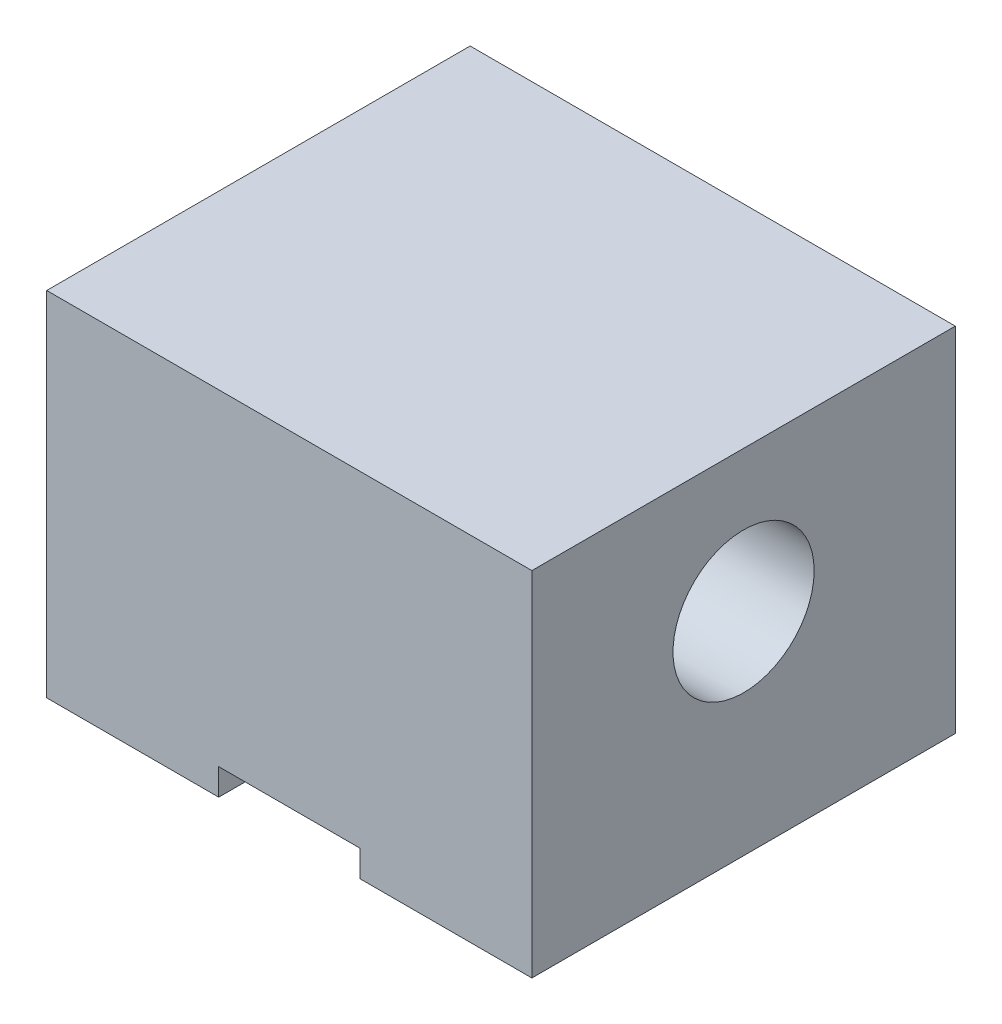
ISO-10303-21;
HEADER;
FILE_DESCRIPTION(('STEP AP214'),'2;1');
FILE_NAME('part.step','',(''),(''),'','','');
FILE_SCHEMA(('AUTOMOTIVE_DESIGN { 1 0 10303 214 1 1 1 1 }'));
ENDSEC;
DATA;
#1=APPLICATION_CONTEXT('core data for automotive mechanical design processes');
#2=APPLICATION_PROTOCOL_DEFINITION('international standard','automotive_design',2000,#1);
#3=PRODUCT_CONTEXT('',#1,'mechanical');
#4=PRODUCT('Part','Part','',(#3));
#5=PRODUCT_RELATED_PRODUCT_CATEGORY('part','',(#4));
#6=PRODUCT_DEFINITION_FORMATION('','',#4);
#7=PRODUCT_DEFINITION_CONTEXT('part definition',#1,'design');
#8=PRODUCT_DEFINITION('design','',#6,#7);
#9=PRODUCT_DEFINITION_SHAPE('','',#8);
#10=(LENGTH_UNIT() NAMED_UNIT(*) SI_UNIT(.MILLI.,.METRE.));
#11=(NAMED_UNIT(*) PLANE_ANGLE_UNIT() SI_UNIT($,.RADIAN.));
#12=(NAMED_UNIT(*) SI_UNIT($,.STERADIAN.) SOLID_ANGLE_UNIT());
#13=UNCERTAINTY_MEASURE_WITH_UNIT(LENGTH_MEASURE(1.E-05),#10,'distance_accuracy_value','');
#14=(GEOMETRIC_REPRESENTATION_CONTEXT(3) GLOBAL_UNCERTAINTY_ASSIGNED_CONTEXT((#13)) GLOBAL_UNIT_ASSIGNED_CONTEXT((#10,
#11,#12)) REPRESENTATION_CONTEXT('',''));
#15=CARTESIAN_POINT('',(0.,0.,0.));
#16=DIRECTION('',(0.,0.,1.));
#17=DIRECTION('',(1.,0.,0.));
#18=AXIS2_PLACEMENT_3D('',#15,#16,#17);
#19=CARTESIAN_POINT('',(0.,0.,0.));
#20=DIRECTION('',(0.,1.,0.));
#21=DIRECTION('',(0.,0.,1.));
#22=AXIS2_PLACEMENT_3D('',#19,#20,#21);
#23=PLANE('',#22);
#24=DIRECTION('',(1.,0.,0.));
#25=VECTOR('',#24,1.);
#26=CARTESIAN_POINT('',(-43.65625,0.,38.1));
#27=LINE('',#26,#25);
#28=CARTESIAN_POINT('',(12.7,0.,38.1));
#29=VERTEX_POINT('',#28);
#30=CARTESIAN_POINT('',(43.65625,0.,38.1));
#31=VERTEX_POINT('',#30);
#32=EDGE_CURVE('E79',#29,#31,#27,.T.);
#33=ORIENTED_EDGE('',*,*,#32,.F.);
#34=DIRECTION('',(0.,0.,1.));
#35=VECTOR('',#34,1.);
#36=CARTESIAN_POINT('',(12.7,0.,-38.1));
#37=LINE('',#36,#35);
#38=CARTESIAN_POINT('',(12.7,0.,-38.1));
#39=VERTEX_POINT('',#38);
#40=EDGE_CURVE('E121',#39,#29,#37,.T.);
#41=ORIENTED_EDGE('',*,*,#40,.F.);
#42=DIRECTION('',(-1.,0.,0.));
#43=VECTOR('',#42,1.);
#44=CARTESIAN_POINT('',(-43.65625,0.,-38.1));
#45=LINE('',#44,#43);
#46=CARTESIAN_POINT('',(43.65625,0.,-38.1));
#47=VERTEX_POINT('',#46);
#48=EDGE_CURVE('E146',#47,#39,#45,.T.);
#49=ORIENTED_EDGE('',*,*,#48,.F.);
#50=DIRECTION('',(0.,0.,-1.));
#51=VECTOR('',#50,1.);
#52=CARTESIAN_POINT('',(43.65625,0.,-38.1));
#53=LINE('',#52,#51);
#54=EDGE_CURVE('E141',#31,#47,#53,.T.);
#55=ORIENTED_EDGE('',*,*,#54,.F.);
#56=EDGE_LOOP('',(#33,#41,#49,#55));
#57=FACE_BOUND('',#56,.T.);
#58=ADVANCED_FACE('F34',(#57),#23,.F.);
#59=CARTESIAN_POINT('',(43.65625,63.5,-38.1));
#60=DIRECTION('',(-1.,0.,0.));
#61=DIRECTION('',(0.,0.,1.));
#62=AXIS2_PLACEMENT_3D('',#59,#60,#61);
#63=PLANE('',#62);
#64=CARTESIAN_POINT('',(43.65625,38.1,0.));
#65=DIRECTION('',(1.,0.,0.));
#66=DIRECTION('',(0.,0.,-1.));
#67=AXIS2_PLACEMENT_3D('',#64,#65,#66);
#68=CIRCLE('',#67,12.7);
#69=CARTESIAN_POINT('',(43.65625,38.1,-12.7));
#70=VERTEX_POINT('',#69);
#71=EDGE_CURVE('E168',#70,#70,#68,.T.);
#72=ORIENTED_EDGE('',*,*,#71,.F.);
#73=EDGE_LOOP('',(#72));
#74=FACE_BOUND('',#73,.T.);
#75=ORIENTED_EDGE('',*,*,#54,.T.);
#76=DIRECTION('',(0.,-1.,0.));
#77=VECTOR('',#76,1.);
#78=CARTESIAN_POINT('',(43.65625,63.5,-38.1));
#79=LINE('',#78,#77);
#80=CARTESIAN_POINT('',(43.65625,63.5,-38.1));
#81=VERTEX_POINT('',#80);
#82=EDGE_CURVE('E11',#81,#47,#79,.T.);
#83=ORIENTED_EDGE('',*,*,#82,.F.);
#84=DIRECTION('',(0.,0.,-1.));
#85=VECTOR('',#84,1.);
#86=CARTESIAN_POINT('',(43.65625,63.5,-38.1));
#87=LINE('',#86,#85);
#88=CARTESIAN_POINT('',(43.65625,63.5,38.1));
#89=VERTEX_POINT('',#88);
#90=EDGE_CURVE('E134',#89,#81,#87,.T.);
#91=ORIENTED_EDGE('',*,*,#90,.F.);
#92=DIRECTION('',(0.,-1.,0.));
#93=VECTOR('',#92,1.);
#94=CARTESIAN_POINT('',(43.65625,63.5,38.1));
#95=LINE('',#94,#93);
#96=EDGE_CURVE('E140',#89,#31,#95,.T.);
#97=ORIENTED_EDGE('',*,*,#96,.T.);
#98=EDGE_LOOP('',(#75,#83,#91,#97));
#99=FACE_BOUND('',#98,.T.);
#100=ADVANCED_FACE('F36',(#74,#99),#63,.F.);
#101=CARTESIAN_POINT('',(-43.65625,63.5,-38.1));
#102=DIRECTION('',(0.,0.,1.));
#103=DIRECTION('',(1.,0.,0.));
#104=AXIS2_PLACEMENT_3D('',#101,#102,#103);
#105=PLANE('',#104);
#106=ORIENTED_EDGE('',*,*,#48,.T.);
#107=DIRECTION('',(0.,-1.,0.));
#108=VECTOR('',#107,1.);
#109=CARTESIAN_POINT('',(12.7,4.7625,-38.1));
#110=LINE('',#109,#108);
#111=CARTESIAN_POINT('',(12.7,4.7625,-38.1));
#112=VERTEX_POINT('',#111);
#113=EDGE_CURVE('E129',#112,#39,#110,.T.);
#114=ORIENTED_EDGE('',*,*,#113,.F.);
#115=DIRECTION('',(1.,0.,0.));
#116=VECTOR('',#115,1.);
#117=CARTESIAN_POINT('',(-12.7,4.7625,-38.1));
#118=LINE('',#117,#116);
#119=CARTESIAN_POINT('',(-12.7,4.7625,-38.1));
#120=VERTEX_POINT('',#119);
#121=EDGE_CURVE('E113',#120,#112,#118,.T.);
#122=ORIENTED_EDGE('',*,*,#121,.F.);
#123=DIRECTION('',(0.,-1.,0.));
#124=VECTOR('',#123,1.);
#125=CARTESIAN_POINT('',(-12.7,4.7625,-38.1));
#126=LINE('',#125,#124);
#127=CARTESIAN_POINT('',(-12.7,0.,-38.1));
#128=VERTEX_POINT('',#127);
#129=EDGE_CURVE('E110',#120,#128,#126,.T.);
#130=ORIENTED_EDGE('',*,*,#129,.T.);
#131=CARTESIAN_POINT('',(-43.65625,0.,-38.1));
#132=VERTEX_POINT('',#131);
#133=EDGE_CURVE('E144',#128,#132,#45,.T.);
#134=ORIENTED_EDGE('',*,*,#133,.T.);
#135=DIRECTION('',(0.,-1.,0.));
#136=VECTOR('',#135,1.);
#137=CARTESIAN_POINT('',(-43.65625,63.5,-38.1));
#138=LINE('',#137,#136);
#139=CARTESIAN_POINT('',(-43.65625,63.5,-38.1));
#140=VERTEX_POINT('',#139);
#141=EDGE_CURVE('E42',#140,#132,#138,.T.);
#142=ORIENTED_EDGE('',*,*,#141,.F.);
#143=DIRECTION('',(-1.,0.,0.));
#144=VECTOR('',#143,1.);
#145=CARTESIAN_POINT('',(-43.65625,63.5,-38.1));
#146=LINE('',#145,#144);
#147=EDGE_CURVE('E86',#81,#140,#146,.T.);
#148=ORIENTED_EDGE('',*,*,#147,.F.);
#149=ORIENTED_EDGE('',*,*,#82,.T.);
#150=EDGE_LOOP('',(#106,#114,#122,#130,#134,#142,#148,#149));
#151=FACE_BOUND('',#150,.T.);
#152=ADVANCED_FACE('F178',(#151),#105,.F.);
#153=CARTESIAN_POINT('',(-43.65625,63.5,-38.1));
#154=DIRECTION('',(1.,0.,0.));
#155=DIRECTION('',(0.,0.,-1.));
#156=AXIS2_PLACEMENT_3D('',#153,#154,#155);
#157=PLANE('',#156);
#158=CARTESIAN_POINT('',(-43.65625,38.1,0.));
#159=DIRECTION('',(1.,0.,0.));
#160=DIRECTION('',(0.,0.,-1.));
#161=AXIS2_PLACEMENT_3D('',#158,#159,#160);
#162=CIRCLE('',#161,12.7);
#163=CARTESIAN_POINT('',(-43.65625,38.1,-12.7));
#164=VERTEX_POINT('',#163);
#165=EDGE_CURVE('E164',#164,#164,#162,.T.);
#166=ORIENTED_EDGE('',*,*,#165,.T.);
#167=EDGE_LOOP('',(#166));
#168=FACE_BOUND('',#167,.T.);
#169=DIRECTION('',(0.,0.,1.));
#170=VECTOR('',#169,1.);
#171=CARTESIAN_POINT('',(-43.65625,0.,-38.1));
#172=LINE('',#171,#170);
#173=CARTESIAN_POINT('',(-43.65625,0.,38.1));
#174=VERTEX_POINT('',#173);
#175=EDGE_CURVE('E149',#132,#174,#172,.T.);
#176=ORIENTED_EDGE('',*,*,#175,.T.);
#177=DIRECTION('',(0.,-1.,0.));
#178=VECTOR('',#177,1.);
#179=CARTESIAN_POINT('',(-43.65625,63.5,38.1));
#180=LINE('',#179,#178);
#181=CARTESIAN_POINT('',(-43.65625,63.5,38.1));
#182=VERTEX_POINT('',#181);
#183=EDGE_CURVE('E153',#182,#174,#180,.T.);
#184=ORIENTED_EDGE('',*,*,#183,.F.);
#185=DIRECTION('',(0.,0.,1.));
#186=VECTOR('',#185,1.);
#187=CARTESIAN_POINT('',(-43.65625,63.5,-38.1));
#188=LINE('',#187,#186);
#189=EDGE_CURVE('E137',#140,#182,#188,.T.);
#190=ORIENTED_EDGE('',*,*,#189,.F.);
#191=ORIENTED_EDGE('',*,*,#141,.T.);
#192=EDGE_LOOP('',(#176,#184,#190,#191));
#193=FACE_BOUND('',#192,.T.);
#194=ADVANCED_FACE('F158',(#168,#193),#157,.F.);
#195=CARTESIAN_POINT('',(-43.65625,63.5,38.1));
#196=DIRECTION('',(0.,0.,-1.));
#197=DIRECTION('',(-1.,0.,0.));
#198=AXIS2_PLACEMENT_3D('',#195,#196,#197);
#199=PLANE('',#198);
#200=DIRECTION('',(-1.,0.,0.));
#201=VECTOR('',#200,1.);
#202=CARTESIAN_POINT('',(12.7,4.7625,38.1));
#203=LINE('',#202,#201);
#204=CARTESIAN_POINT('',(12.7,4.7625,38.1));
#205=VERTEX_POINT('',#204);
#206=CARTESIAN_POINT('',(-12.7,4.7625,38.1));
#207=VERTEX_POINT('',#206);
#208=EDGE_CURVE('E114',#205,#207,#203,.T.);
#209=ORIENTED_EDGE('',*,*,#208,.F.);
#210=DIRECTION('',(0.,-1.,0.));
#211=VECTOR('',#210,1.);
#212=CARTESIAN_POINT('',(12.7,4.7625,38.1));
#213=LINE('',#212,#211);
#214=EDGE_CURVE('E145',#205,#29,#213,.T.);
#215=ORIENTED_EDGE('',*,*,#214,.T.);
#216=ORIENTED_EDGE('',*,*,#32,.T.);
#217=ORIENTED_EDGE('',*,*,#96,.F.);
#218=DIRECTION('',(1.,0.,0.));
#219=VECTOR('',#218,1.);
#220=CARTESIAN_POINT('',(-43.65625,63.5,38.1));
#221=LINE('',#220,#219);
#222=EDGE_CURVE('E58',#182,#89,#221,.T.);
#223=ORIENTED_EDGE('',*,*,#222,.F.);
#224=ORIENTED_EDGE('',*,*,#183,.T.);
#225=CARTESIAN_POINT('',(-12.7,0.,38.1));
#226=VERTEX_POINT('',#225);
#227=EDGE_CURVE('E127',#174,#226,#27,.T.);
#228=ORIENTED_EDGE('',*,*,#227,.T.);
#229=DIRECTION('',(0.,-1.,0.));
#230=VECTOR('',#229,1.);
#231=CARTESIAN_POINT('',(-12.7,4.7625,38.1));
#232=LINE('',#231,#230);
#233=EDGE_CURVE('E49',#207,#226,#232,.T.);
#234=ORIENTED_EDGE('',*,*,#233,.F.);
#235=EDGE_LOOP('',(#209,#215,#216,#217,#223,#224,#228,#234));
#236=FACE_BOUND('',#235,.T.);
#237=ADVANCED_FACE('F124',(#236),#199,.F.);
#238=CARTESIAN_POINT('',(0.,63.5,0.));
#239=DIRECTION('',(0.,1.,0.));
#240=DIRECTION('',(0.,0.,1.));
#241=AXIS2_PLACEMENT_3D('',#238,#239,#240);
#242=PLANE('',#241);
#243=ORIENTED_EDGE('',*,*,#90,.T.);
#244=ORIENTED_EDGE('',*,*,#147,.T.);
#245=ORIENTED_EDGE('',*,*,#189,.T.);
#246=ORIENTED_EDGE('',*,*,#222,.T.);
#247=EDGE_LOOP('',(#243,#244,#245,#246));
#248=FACE_BOUND('',#247,.T.);
#249=ADVANCED_FACE('F182',(#248),#242,.T.);
#250=ORIENTED_EDGE('',*,*,#133,.F.);
#251=DIRECTION('',(0.,0.,-1.));
#252=VECTOR('',#251,1.);
#253=CARTESIAN_POINT('',(-12.7,0.,38.1));
#254=LINE('',#253,#252);
#255=EDGE_CURVE('E163',#226,#128,#254,.T.);
#256=ORIENTED_EDGE('',*,*,#255,.F.);
#257=ORIENTED_EDGE('',*,*,#227,.F.);
#258=ORIENTED_EDGE('',*,*,#175,.F.);
#259=EDGE_LOOP('',(#250,#256,#257,#258));
#260=FACE_BOUND('',#259,.T.);
#261=ADVANCED_FACE('F162',(#260),#23,.F.);
#262=CARTESIAN_POINT('',(12.7,4.7625,-38.1));
#263=DIRECTION('',(1.,0.,0.));
#264=DIRECTION('',(0.,0.,-1.));
#265=AXIS2_PLACEMENT_3D('',#262,#263,#264);
#266=PLANE('',#265);
#267=ORIENTED_EDGE('',*,*,#40,.T.);
#268=ORIENTED_EDGE('',*,*,#214,.F.);
#269=DIRECTION('',(0.,0.,1.));
#270=VECTOR('',#269,1.);
#271=CARTESIAN_POINT('',(12.7,4.7625,-38.1));
#272=LINE('',#271,#270);
#273=EDGE_CURVE('E120',#112,#205,#272,.T.);
#274=ORIENTED_EDGE('',*,*,#273,.F.);
#275=ORIENTED_EDGE('',*,*,#113,.T.);
#276=EDGE_LOOP('',(#267,#268,#274,#275));
#277=FACE_BOUND('',#276,.T.);
#278=ADVANCED_FACE('F175',(#277),#266,.F.);
#279=CARTESIAN_POINT('',(-12.7,4.7625,38.1));
#280=DIRECTION('',(-1.,0.,0.));
#281=DIRECTION('',(0.,0.,1.));
#282=AXIS2_PLACEMENT_3D('',#279,#280,#281);
#283=PLANE('',#282);
#284=ORIENTED_EDGE('',*,*,#255,.T.);
#285=ORIENTED_EDGE('',*,*,#129,.F.);
#286=DIRECTION('',(0.,0.,-1.));
#287=VECTOR('',#286,1.);
#288=CARTESIAN_POINT('',(-12.7,4.7625,38.1));
#289=LINE('',#288,#287);
#290=EDGE_CURVE('E106',#207,#120,#289,.T.);
#291=ORIENTED_EDGE('',*,*,#290,.F.);
#292=ORIENTED_EDGE('',*,*,#233,.T.);
#293=EDGE_LOOP('',(#284,#285,#291,#292));
#294=FACE_BOUND('',#293,.T.);
#295=ADVANCED_FACE('F108',(#294),#283,.F.);
#296=CARTESIAN_POINT('',(0.,4.7625,0.));
#297=DIRECTION('',(0.,-1.,0.));
#298=DIRECTION('',(0.,0.,-1.));
#299=AXIS2_PLACEMENT_3D('',#296,#297,#298);
#300=PLANE('',#299);
#301=ORIENTED_EDGE('',*,*,#208,.T.);
#302=ORIENTED_EDGE('',*,*,#290,.T.);
#303=ORIENTED_EDGE('',*,*,#121,.T.);
#304=ORIENTED_EDGE('',*,*,#273,.T.);
#305=EDGE_LOOP('',(#301,#302,#303,#304));
#306=FACE_BOUND('',#305,.T.);
#307=ADVANCED_FACE('F118',(#306),#300,.T.);
#308=CARTESIAN_POINT('',(-43.65625,38.1,0.));
#309=DIRECTION('',(1.,0.,0.));
#310=DIRECTION('',(0.,0.,-1.));
#311=AXIS2_PLACEMENT_3D('',#308,#309,#310);
#312=CYLINDRICAL_SURFACE('',#311,12.7);
#313=ORIENTED_EDGE('',*,*,#165,.F.);
#314=EDGE_LOOP('',(#313));
#315=FACE_BOUND('',#314,.T.);
#316=ORIENTED_EDGE('',*,*,#71,.T.);
#317=EDGE_LOOP('',(#316));
#318=FACE_BOUND('',#317,.T.);
#319=ADVANCED_FACE('F245',(#315,#318),#312,.F.);
#320=CLOSED_SHELL('',(#58,#100,#152,#194,#237,#249,#261,#278,#295,#307,#319));
#321=MANIFOLD_SOLID_BREP('B2',#320);
#322=ADVANCED_BREP_SHAPE_REPRESENTATION('',(#18,#321),#14);
#323=SHAPE_DEFINITION_REPRESENTATION(#9,#322);
ENDSEC;
END-ISO-10303-21;
